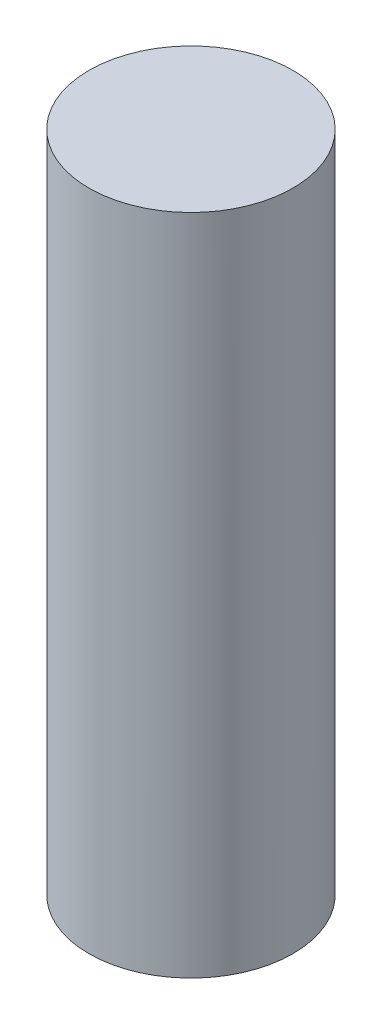
ISO-10303-21;
HEADER;
FILE_DESCRIPTION(('STEP AP214'),'2;1');
FILE_NAME('part.step','',(''),(''),'','','');
FILE_SCHEMA(('AUTOMOTIVE_DESIGN { 1 0 10303 214 1 1 1 1 }'));
ENDSEC;
DATA;
#1=APPLICATION_CONTEXT('core data for automotive mechanical design processes');
#2=APPLICATION_PROTOCOL_DEFINITION('international standard','automotive_design',2000,#1);
#3=PRODUCT_CONTEXT('',#1,'mechanical');
#4=PRODUCT('Part','Part','',(#3));
#5=PRODUCT_RELATED_PRODUCT_CATEGORY('part','',(#4));
#6=PRODUCT_DEFINITION_FORMATION('','',#4);
#7=PRODUCT_DEFINITION_CONTEXT('part definition',#1,'design');
#8=PRODUCT_DEFINITION('design','',#6,#7);
#9=PRODUCT_DEFINITION_SHAPE('','',#8);
#10=(LENGTH_UNIT() NAMED_UNIT(*) SI_UNIT(.MILLI.,.METRE.));
#11=(NAMED_UNIT(*) PLANE_ANGLE_UNIT() SI_UNIT($,.RADIAN.));
#12=(NAMED_UNIT(*) SI_UNIT($,.STERADIAN.) SOLID_ANGLE_UNIT());
#13=UNCERTAINTY_MEASURE_WITH_UNIT(LENGTH_MEASURE(1.E-05),#10,'distance_accuracy_value','');
#14=(GEOMETRIC_REPRESENTATION_CONTEXT(3) GLOBAL_UNCERTAINTY_ASSIGNED_CONTEXT((#13)) GLOBAL_UNIT_ASSIGNED_CONTEXT((#10,
#11,#12)) REPRESENTATION_CONTEXT('',''));
#15=CARTESIAN_POINT('',(0.,0.,0.));
#16=DIRECTION('',(0.,0.,1.));
#17=DIRECTION('',(1.,0.,0.));
#18=AXIS2_PLACEMENT_3D('',#15,#16,#17);
#19=CARTESIAN_POINT('',(-2.,13.,0.));
#20=DIRECTION('',(0.,1.,0.));
#21=DIRECTION('',(-1.,0.,0.));
#22=AXIS2_PLACEMENT_3D('',#19,#20,#21);
#23=PLANE('',#22);
#24=CARTESIAN_POINT('',(0.,13.,0.));
#25=DIRECTION('',(0.,1.,0.));
#26=DIRECTION('',(-1.,0.,0.));
#27=AXIS2_PLACEMENT_3D('',#24,#25,#26);
#28=CIRCLE('',#27,2.);
#29=CARTESIAN_POINT('',(-2.,13.,0.));
#30=VERTEX_POINT('',#29);
#31=EDGE_CURVE('E10',#30,#30,#28,.T.);
#32=ORIENTED_EDGE('',*,*,#31,.T.);
#33=EDGE_LOOP('',(#32));
#34=FACE_BOUND('',#33,.T.);
#35=ADVANCED_FACE('F36',(#34),#23,.T.);
#36=CARTESIAN_POINT('',(0.,13.,0.));
#37=DIRECTION('',(0.,1.,0.));
#38=DIRECTION('',(-1.,0.,0.));
#39=AXIS2_PLACEMENT_3D('',#36,#37,#38);
#40=CYLINDRICAL_SURFACE('',#39,2.);
#41=ORIENTED_EDGE('',*,*,#31,.F.);
#42=EDGE_LOOP('',(#41));
#43=FACE_BOUND('',#42,.T.);
#44=CARTESIAN_POINT('',(0.,0.,0.));
#45=DIRECTION('',(0.,-1.,0.));
#46=DIRECTION('',(1.,0.,0.));
#47=AXIS2_PLACEMENT_3D('',#44,#45,#46);
#48=CIRCLE('',#47,2.);
#49=CARTESIAN_POINT('',(2.,0.,0.));
#50=VERTEX_POINT('',#49);
#51=EDGE_CURVE('E44',#50,#50,#48,.F.);
#52=ORIENTED_EDGE('',*,*,#51,.T.);
#53=EDGE_LOOP('',(#52));
#54=FACE_BOUND('',#53,.T.);
#55=ADVANCED_FACE('F51',(#43,#54),#40,.T.);
#56=CARTESIAN_POINT('',(0.,0.,0.));
#57=DIRECTION('',(0.,-1.,0.));
#58=DIRECTION('',(1.,0.,0.));
#59=AXIS2_PLACEMENT_3D('',#56,#57,#58);
#60=PLANE('',#59);
#61=ORIENTED_EDGE('',*,*,#51,.F.);
#62=EDGE_LOOP('',(#61));
#63=FACE_BOUND('',#62,.T.);
#64=ADVANCED_FACE('F38',(#63),#60,.T.);
#65=CLOSED_SHELL('',(#35,#55,#64));
#66=MANIFOLD_SOLID_BREP('B2',#65);
#67=ADVANCED_BREP_SHAPE_REPRESENTATION('',(#18,#66),#14);
#68=SHAPE_DEFINITION_REPRESENTATION(#9,#67);
ENDSEC;
END-ISO-10303-21;
